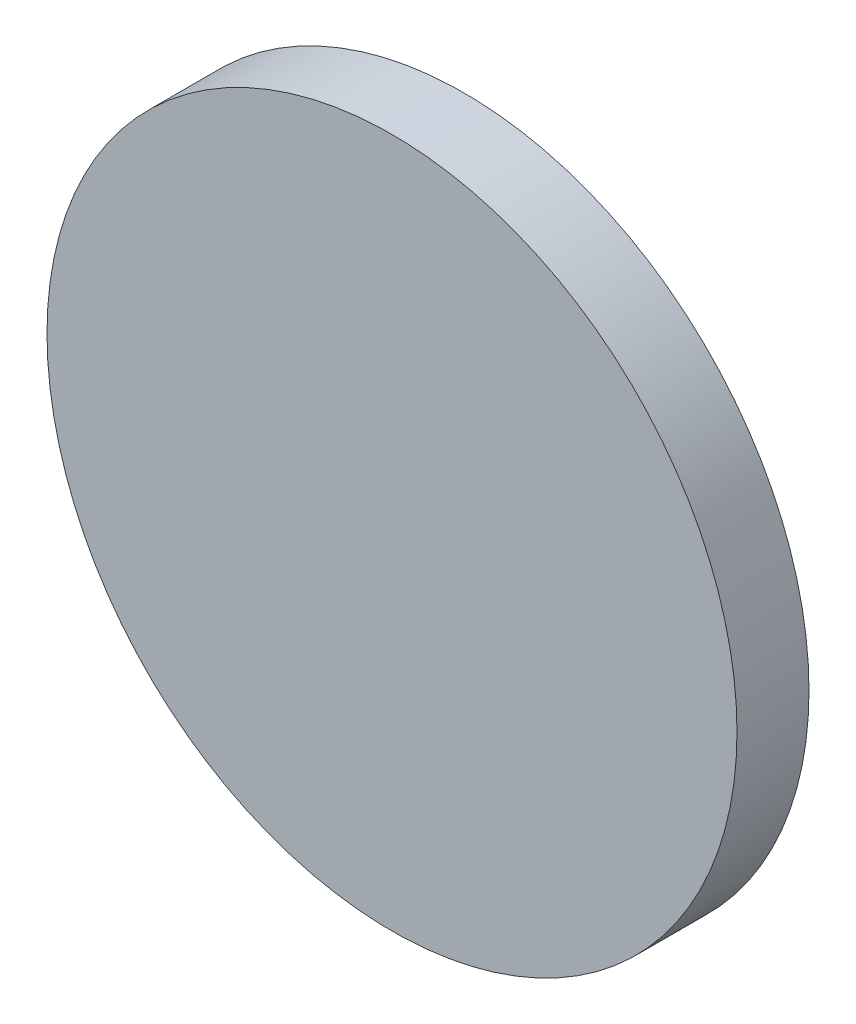
ISO-10303-21;
HEADER;
FILE_DESCRIPTION(('STEP AP214'),'2;1');
FILE_NAME('part.step','',(''),(''),'','','');
FILE_SCHEMA(('AUTOMOTIVE_DESIGN { 1 0 10303 214 1 1 1 1 }'));
ENDSEC;
DATA;
#1=APPLICATION_CONTEXT('core data for automotive mechanical design processes');
#2=APPLICATION_PROTOCOL_DEFINITION('international standard','automotive_design',2000,#1);
#3=PRODUCT_CONTEXT('',#1,'mechanical');
#4=PRODUCT('Part','Part','',(#3));
#5=PRODUCT_RELATED_PRODUCT_CATEGORY('part','',(#4));
#6=PRODUCT_DEFINITION_FORMATION('','',#4);
#7=PRODUCT_DEFINITION_CONTEXT('part definition',#1,'design');
#8=PRODUCT_DEFINITION('design','',#6,#7);
#9=PRODUCT_DEFINITION_SHAPE('','',#8);
#10=(LENGTH_UNIT() NAMED_UNIT(*) SI_UNIT(.MILLI.,.METRE.));
#11=(NAMED_UNIT(*) PLANE_ANGLE_UNIT() SI_UNIT($,.RADIAN.));
#12=(NAMED_UNIT(*) SI_UNIT($,.STERADIAN.) SOLID_ANGLE_UNIT());
#13=UNCERTAINTY_MEASURE_WITH_UNIT(LENGTH_MEASURE(1.E-05),#10,'distance_accuracy_value','');
#14=(GEOMETRIC_REPRESENTATION_CONTEXT(3) GLOBAL_UNCERTAINTY_ASSIGNED_CONTEXT((#13)) GLOBAL_UNIT_ASSIGNED_CONTEXT((#10,
#11,#12)) REPRESENTATION_CONTEXT('',''));
#15=CARTESIAN_POINT('',(0.,0.,0.));
#16=DIRECTION('',(0.,0.,1.));
#17=DIRECTION('',(1.,0.,0.));
#18=AXIS2_PLACEMENT_3D('',#15,#16,#17);
#19=CARTESIAN_POINT('',(0.,0.,24.));
#20=DIRECTION('',(0.,0.,-1.));
#21=DIRECTION('',(-1.,0.,0.));
#22=AXIS2_PLACEMENT_3D('',#19,#20,#21);
#23=CYLINDRICAL_SURFACE('',#22,115.);
#24=CARTESIAN_POINT('',(0.,0.,24.));
#25=DIRECTION('',(0.,0.,1.));
#26=DIRECTION('',(1.,0.,0.));
#27=AXIS2_PLACEMENT_3D('',#24,#25,#26);
#28=CIRCLE('',#27,115.);
#29=CARTESIAN_POINT('',(115.,0.,24.));
#30=VERTEX_POINT('',#29);
#31=EDGE_CURVE('E10',#30,#30,#28,.T.);
#32=ORIENTED_EDGE('',*,*,#31,.F.);
#33=EDGE_LOOP('',(#32));
#34=FACE_BOUND('',#33,.T.);
#35=CARTESIAN_POINT('',(0.,0.,0.));
#36=DIRECTION('',(0.,0.,1.));
#37=DIRECTION('',(1.,0.,0.));
#38=AXIS2_PLACEMENT_3D('',#35,#36,#37);
#39=CIRCLE('',#38,115.);
#40=CARTESIAN_POINT('',(115.,0.,0.));
#41=VERTEX_POINT('',#40);
#42=EDGE_CURVE('E46',#41,#41,#39,.T.);
#43=ORIENTED_EDGE('',*,*,#42,.T.);
#44=EDGE_LOOP('',(#43));
#45=FACE_BOUND('',#44,.T.);
#46=ADVANCED_FACE('F43',(#34,#45),#23,.T.);
#47=CARTESIAN_POINT('',(0.,0.,24.));
#48=DIRECTION('',(0.,0.,1.));
#49=DIRECTION('',(1.,0.,0.));
#50=AXIS2_PLACEMENT_3D('',#47,#48,#49);
#51=PLANE('',#50);
#52=ORIENTED_EDGE('',*,*,#31,.T.);
#53=EDGE_LOOP('',(#52));
#54=FACE_BOUND('',#53,.T.);
#55=ADVANCED_FACE('F60',(#54),#51,.T.);
#56=CARTESIAN_POINT('',(0.,0.,0.));
#57=DIRECTION('',(0.,0.,1.));
#58=DIRECTION('',(1.,0.,0.));
#59=AXIS2_PLACEMENT_3D('',#56,#57,#58);
#60=PLANE('',#59);
#61=ORIENTED_EDGE('',*,*,#42,.F.);
#62=EDGE_LOOP('',(#61));
#63=FACE_BOUND('',#62,.T.);
#64=ADVANCED_FACE('F58',(#63),#60,.F.);
#65=CLOSED_SHELL('',(#46,#55,#64));
#66=MANIFOLD_SOLID_BREP('B2',#65);
#67=ADVANCED_BREP_SHAPE_REPRESENTATION('',(#18,#66),#14);
#68=SHAPE_DEFINITION_REPRESENTATION(#9,#67);
ENDSEC;
END-ISO-10303-21;
